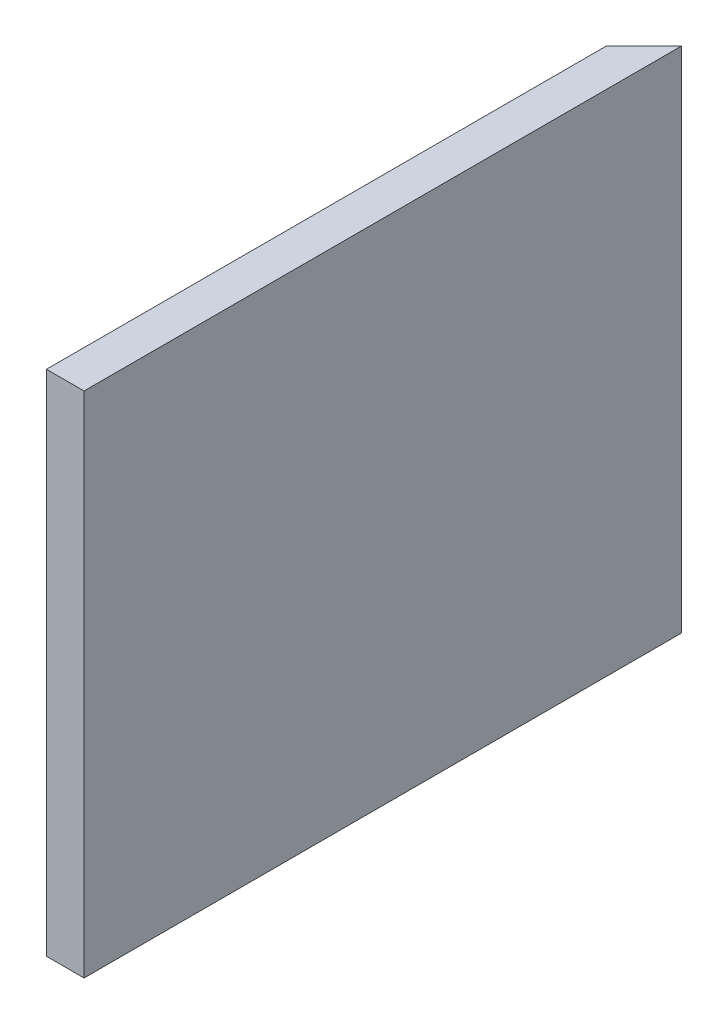
ISO-10303-21;
HEADER;
FILE_DESCRIPTION(('STEP AP214'),'2;1');
FILE_NAME('part.step','',(''),(''),'','','');
FILE_SCHEMA(('AUTOMOTIVE_DESIGN { 1 0 10303 214 1 1 1 1 }'));
ENDSEC;
DATA;
#1=APPLICATION_CONTEXT('core data for automotive mechanical design processes');
#2=APPLICATION_PROTOCOL_DEFINITION('international standard','automotive_design',2000,#1);
#3=PRODUCT_CONTEXT('',#1,'mechanical');
#4=PRODUCT('Part','Part','',(#3));
#5=PRODUCT_RELATED_PRODUCT_CATEGORY('part','',(#4));
#6=PRODUCT_DEFINITION_FORMATION('','',#4);
#7=PRODUCT_DEFINITION_CONTEXT('part definition',#1,'design');
#8=PRODUCT_DEFINITION('design','',#6,#7);
#9=PRODUCT_DEFINITION_SHAPE('','',#8);
#10=(LENGTH_UNIT() NAMED_UNIT(*) SI_UNIT(.MILLI.,.METRE.));
#11=(NAMED_UNIT(*) PLANE_ANGLE_UNIT() SI_UNIT($,.RADIAN.));
#12=(NAMED_UNIT(*) SI_UNIT($,.STERADIAN.) SOLID_ANGLE_UNIT());
#13=UNCERTAINTY_MEASURE_WITH_UNIT(LENGTH_MEASURE(1.E-05),#10,'distance_accuracy_value','');
#14=(GEOMETRIC_REPRESENTATION_CONTEXT(3) GLOBAL_UNCERTAINTY_ASSIGNED_CONTEXT((#13)) GLOBAL_UNIT_ASSIGNED_CONTEXT((#10,
#11,#12)) REPRESENTATION_CONTEXT('',''));
#15=CARTESIAN_POINT('',(0.,0.,0.));
#16=DIRECTION('',(0.,0.,1.));
#17=DIRECTION('',(1.,0.,0.));
#18=AXIS2_PLACEMENT_3D('',#15,#16,#17);
#19=CARTESIAN_POINT('',(189.128399999999,171.7294,-403.340213805219));
#20=DIRECTION('',(-1.,0.,0.));
#21=DIRECTION('',(0.,-1.,0.));
#22=AXIS2_PLACEMENT_3D('',#19,#20,#21);
#23=PLANE('',#22);
#24=DIRECTION('',(0.,1.,0.));
#25=VECTOR('',#24,1.);
#26=CARTESIAN_POINT('',(189.128399999999,171.729399999998,-189.128399999999));
#27=LINE('',#26,#25);
#28=CARTESIAN_POINT('',(189.1284,0.,-189.1284));
#29=VERTEX_POINT('',#28);
#30=CARTESIAN_POINT('',(189.128399999999,171.7294,-189.128399999999));
#31=VERTEX_POINT('',#30);
#32=EDGE_CURVE('E48',#29,#31,#27,.T.);
#33=ORIENTED_EDGE('',*,*,#32,.F.);
#34=DIRECTION('',(0.,0.,1.));
#35=VECTOR('',#34,1.);
#36=CARTESIAN_POINT('',(189.1284,0.,-403.340213805219));
#37=LINE('',#36,#35);
#38=CARTESIAN_POINT('',(189.1284,0.,0.));
#39=VERTEX_POINT('',#38);
#40=EDGE_CURVE('E76',#29,#39,#37,.T.);
#41=ORIENTED_EDGE('',*,*,#40,.T.);
#42=DIRECTION('',(0.,-1.,0.));
#43=VECTOR('',#42,1.);
#44=CARTESIAN_POINT('',(189.128399999999,171.7294,0.));
#45=LINE('',#44,#43);
#46=CARTESIAN_POINT('',(189.128399999999,171.7294,0.));
#47=VERTEX_POINT('',#46);
#48=EDGE_CURVE('E80',#47,#39,#45,.T.);
#49=ORIENTED_EDGE('',*,*,#48,.F.);
#50=DIRECTION('',(0.,0.,1.));
#51=VECTOR('',#50,1.);
#52=CARTESIAN_POINT('',(189.128399999999,171.7294,-403.340213805219));
#53=LINE('',#52,#51);
#54=EDGE_CURVE('E108',#31,#47,#53,.T.);
#55=ORIENTED_EDGE('',*,*,#54,.F.);
#56=EDGE_LOOP('',(#33,#41,#49,#55));
#57=FACE_BOUND('',#56,.T.);
#58=ADVANCED_FACE('F39',(#57),#23,.T.);
#59=CARTESIAN_POINT('',(201.828399999999,171.7294,-403.340213805219));
#60=DIRECTION('',(0.,1.,0.));
#61=DIRECTION('',(0.,0.,1.));
#62=AXIS2_PLACEMENT_3D('',#59,#60,#61);
#63=PLANE('',#62);
#64=DIRECTION('',(0.707106781186548,0.,-0.707106781186548));
#65=VECTOR('',#64,1.);
#66=CARTESIAN_POINT('',(302.584306902609,171.7294,-302.584306902609));
#67=LINE('',#66,#65);
#68=CARTESIAN_POINT('',(201.828399999999,171.7294,-201.828399999999));
#69=VERTEX_POINT('',#68);
#70=EDGE_CURVE('E54',#31,#69,#67,.T.);
#71=ORIENTED_EDGE('',*,*,#70,.F.);
#72=ORIENTED_EDGE('',*,*,#54,.T.);
#73=DIRECTION('',(-1.,0.,0.));
#74=VECTOR('',#73,1.);
#75=CARTESIAN_POINT('',(201.828399999999,171.7294,0.));
#76=LINE('',#75,#74);
#77=CARTESIAN_POINT('',(201.828399999999,171.7294,0.));
#78=VERTEX_POINT('',#77);
#79=EDGE_CURVE('E86',#78,#47,#76,.T.);
#80=ORIENTED_EDGE('',*,*,#79,.F.);
#81=DIRECTION('',(0.,0.,1.));
#82=VECTOR('',#81,1.);
#83=CARTESIAN_POINT('',(201.828399999999,171.7294,-403.340213805219));
#84=LINE('',#83,#82);
#85=EDGE_CURVE('E112',#69,#78,#84,.T.);
#86=ORIENTED_EDGE('',*,*,#85,.F.);
#87=EDGE_LOOP('',(#71,#72,#80,#86));
#88=FACE_BOUND('',#87,.T.);
#89=ADVANCED_FACE('F123',(#88),#63,.T.);
#90=CARTESIAN_POINT('',(201.8284,0.,-403.340213805219));
#91=DIRECTION('',(1.,0.,0.));
#92=DIRECTION('',(0.,1.,0.));
#93=AXIS2_PLACEMENT_3D('',#90,#91,#92);
#94=PLANE('',#93);
#95=DIRECTION('',(0.,-1.,0.));
#96=VECTOR('',#95,1.);
#97=CARTESIAN_POINT('',(201.8284,-1.46561064877708E-12,-201.8284));
#98=LINE('',#97,#96);
#99=CARTESIAN_POINT('',(201.8284,0.,-201.8284));
#100=VERTEX_POINT('',#99);
#101=EDGE_CURVE('E111',#69,#100,#98,.T.);
#102=ORIENTED_EDGE('',*,*,#101,.F.);
#103=ORIENTED_EDGE('',*,*,#85,.T.);
#104=DIRECTION('',(0.,1.,0.));
#105=VECTOR('',#104,1.);
#106=CARTESIAN_POINT('',(201.8284,0.,0.));
#107=LINE('',#106,#105);
#108=CARTESIAN_POINT('',(201.8284,0.,0.));
#109=VERTEX_POINT('',#108);
#110=EDGE_CURVE('E95',#109,#78,#107,.T.);
#111=ORIENTED_EDGE('',*,*,#110,.F.);
#112=DIRECTION('',(0.,0.,1.));
#113=VECTOR('',#112,1.);
#114=CARTESIAN_POINT('',(201.8284,0.,-403.340213805219));
#115=LINE('',#114,#113);
#116=EDGE_CURVE('E85',#100,#109,#115,.T.);
#117=ORIENTED_EDGE('',*,*,#116,.F.);
#118=EDGE_LOOP('',(#102,#103,#111,#117));
#119=FACE_BOUND('',#118,.T.);
#120=ADVANCED_FACE('F125',(#119),#94,.T.);
#121=CARTESIAN_POINT('',(189.1284,0.,-403.340213805219));
#122=DIRECTION('',(0.,-1.,0.));
#123=DIRECTION('',(0.,0.,-1.));
#124=AXIS2_PLACEMENT_3D('',#121,#122,#123);
#125=PLANE('',#124);
#126=DIRECTION('',(-0.707106781186548,0.,0.707106781186548));
#127=VECTOR('',#126,1.);
#128=CARTESIAN_POINT('',(296.234306902609,0.,-296.234306902609));
#129=LINE('',#128,#127);
#130=EDGE_CURVE('E11',#100,#29,#129,.T.);
#131=ORIENTED_EDGE('',*,*,#130,.F.);
#132=ORIENTED_EDGE('',*,*,#116,.T.);
#133=DIRECTION('',(1.,0.,0.));
#134=VECTOR('',#133,1.);
#135=CARTESIAN_POINT('',(189.1284,0.,0.));
#136=LINE('',#135,#134);
#137=EDGE_CURVE('E88',#39,#109,#136,.T.);
#138=ORIENTED_EDGE('',*,*,#137,.F.);
#139=ORIENTED_EDGE('',*,*,#40,.F.);
#140=EDGE_LOOP('',(#131,#132,#138,#139));
#141=FACE_BOUND('',#140,.T.);
#142=ADVANCED_FACE('F89',(#141),#125,.T.);
#143=CARTESIAN_POINT('',(0.,0.,0.));
#144=DIRECTION('',(0.,0.,1.));
#145=DIRECTION('',(1.,0.,0.));
#146=AXIS2_PLACEMENT_3D('',#143,#144,#145);
#147=PLANE('',#146);
#148=ORIENTED_EDGE('',*,*,#48,.T.);
#149=ORIENTED_EDGE('',*,*,#137,.T.);
#150=ORIENTED_EDGE('',*,*,#110,.T.);
#151=ORIENTED_EDGE('',*,*,#79,.T.);
#152=EDGE_LOOP('',(#148,#149,#150,#151));
#153=FACE_BOUND('',#152,.T.);
#154=ADVANCED_FACE('F97',(#153),#147,.T.);
#155=CARTESIAN_POINT('',(0.,0.,0.));
#156=DIRECTION('',(0.707106781186548,0.,0.707106781186548));
#157=DIRECTION('',(0.707106781186548,0.,-0.707106781186548));
#158=AXIS2_PLACEMENT_3D('',#155,#156,#157);
#159=PLANE('',#158);
#160=ORIENTED_EDGE('',*,*,#32,.T.);
#161=ORIENTED_EDGE('',*,*,#70,.T.);
#162=ORIENTED_EDGE('',*,*,#101,.T.);
#163=ORIENTED_EDGE('',*,*,#130,.T.);
#164=EDGE_LOOP('',(#160,#161,#162,#163));
#165=FACE_BOUND('',#164,.T.);
#166=ADVANCED_FACE('F120',(#165),#159,.F.);
#167=CLOSED_SHELL('',(#58,#89,#120,#142,#154,#166));
#168=MANIFOLD_SOLID_BREP('B2',#167);
#169=ADVANCED_BREP_SHAPE_REPRESENTATION('',(#18,#168),#14);
#170=SHAPE_DEFINITION_REPRESENTATION(#9,#169);
ENDSEC;
END-ISO-10303-21;
